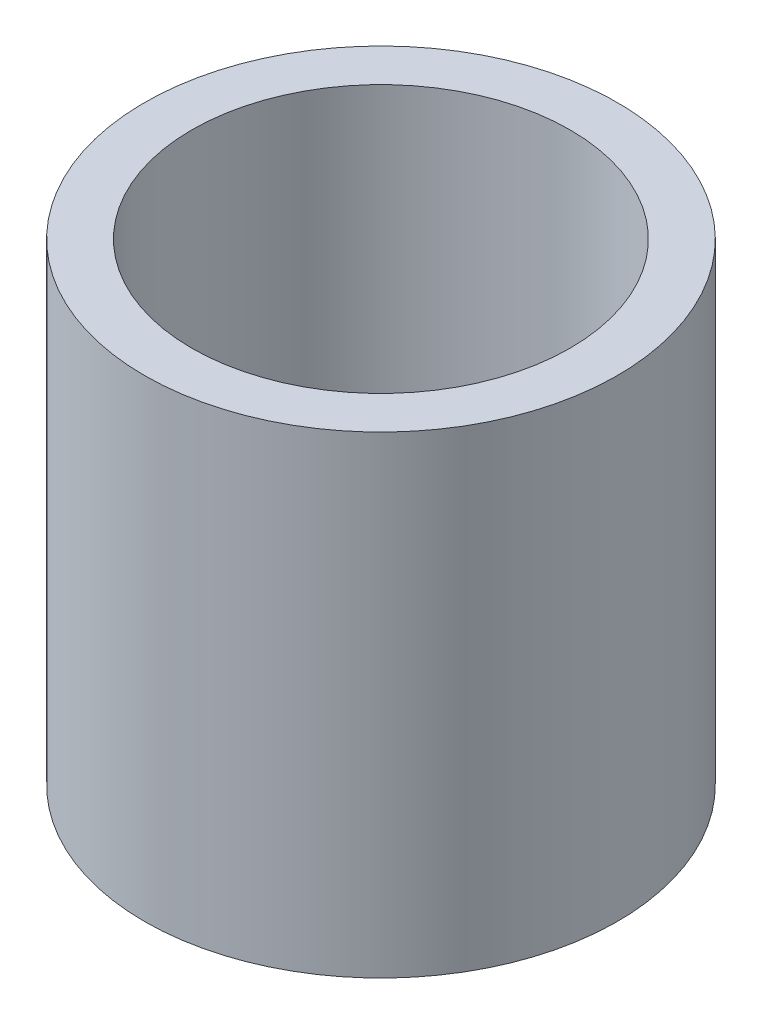
ISO-10303-21;
HEADER;
FILE_DESCRIPTION(('STEP AP214'),'2;1');
FILE_NAME('part.step','',(''),(''),'','','');
FILE_SCHEMA(('AUTOMOTIVE_DESIGN { 1 0 10303 214 1 1 1 1 }'));
ENDSEC;
DATA;
#1=APPLICATION_CONTEXT('core data for automotive mechanical design processes');
#2=APPLICATION_PROTOCOL_DEFINITION('international standard','automotive_design',2000,#1);
#3=PRODUCT_CONTEXT('',#1,'mechanical');
#4=PRODUCT('Part','Part','',(#3));
#5=PRODUCT_RELATED_PRODUCT_CATEGORY('part','',(#4));
#6=PRODUCT_DEFINITION_FORMATION('','',#4);
#7=PRODUCT_DEFINITION_CONTEXT('part definition',#1,'design');
#8=PRODUCT_DEFINITION('design','',#6,#7);
#9=PRODUCT_DEFINITION_SHAPE('','',#8);
#10=(LENGTH_UNIT() NAMED_UNIT(*) SI_UNIT(.MILLI.,.METRE.));
#11=(NAMED_UNIT(*) PLANE_ANGLE_UNIT() SI_UNIT($,.RADIAN.));
#12=(NAMED_UNIT(*) SI_UNIT($,.STERADIAN.) SOLID_ANGLE_UNIT());
#13=UNCERTAINTY_MEASURE_WITH_UNIT(LENGTH_MEASURE(1.E-05),#10,'distance_accuracy_value','');
#14=(GEOMETRIC_REPRESENTATION_CONTEXT(3) GLOBAL_UNCERTAINTY_ASSIGNED_CONTEXT((#13)) GLOBAL_UNIT_ASSIGNED_CONTEXT((#10,
#11,#12)) REPRESENTATION_CONTEXT('',''));
#15=CARTESIAN_POINT('',(0.,0.,0.));
#16=DIRECTION('',(0.,0.,1.));
#17=DIRECTION('',(1.,0.,0.));
#18=AXIS2_PLACEMENT_3D('',#15,#16,#17);
#19=CARTESIAN_POINT('',(0.,6.35,0.));
#20=DIRECTION('',(0.,1.,0.));
#21=DIRECTION('',(0.,0.,1.));
#22=AXIS2_PLACEMENT_3D('',#19,#20,#21);
#23=PLANE('',#22);
#24=CARTESIAN_POINT('',(0.,6.35,0.));
#25=DIRECTION('',(0.,1.,0.));
#26=DIRECTION('',(0.,0.,1.));
#27=AXIS2_PLACEMENT_3D('',#24,#25,#26);
#28=CIRCLE('',#27,3.175);
#29=CARTESIAN_POINT('',(0.,6.35,3.175));
#30=VERTEX_POINT('',#29);
#31=EDGE_CURVE('E10',#30,#30,#28,.T.);
#32=ORIENTED_EDGE('',*,*,#31,.T.);
#33=EDGE_LOOP('',(#32));
#34=FACE_BOUND('',#33,.T.);
#35=CARTESIAN_POINT('',(0.,6.35,0.));
#36=DIRECTION('',(0.,1.,0.));
#37=DIRECTION('',(0.,0.,1.));
#38=AXIS2_PLACEMENT_3D('',#35,#36,#37);
#39=CIRCLE('',#38,2.54);
#40=CARTESIAN_POINT('',(0.,6.35,2.54));
#41=VERTEX_POINT('',#40);
#42=EDGE_CURVE('E42',#41,#41,#39,.T.);
#43=ORIENTED_EDGE('',*,*,#42,.F.);
#44=EDGE_LOOP('',(#43));
#45=FACE_BOUND('',#44,.T.);
#46=ADVANCED_FACE('F31',(#34,#45),#23,.T.);
#47=CARTESIAN_POINT('',(0.,0.,0.));
#48=DIRECTION('',(0.,1.,0.));
#49=DIRECTION('',(0.,0.,1.));
#50=AXIS2_PLACEMENT_3D('',#47,#48,#49);
#51=PLANE('',#50);
#52=CARTESIAN_POINT('',(0.,0.,0.));
#53=DIRECTION('',(0.,1.,0.));
#54=DIRECTION('',(0.,0.,1.));
#55=AXIS2_PLACEMENT_3D('',#52,#53,#54);
#56=CIRCLE('',#55,3.175);
#57=CARTESIAN_POINT('',(0.,0.,3.175));
#58=VERTEX_POINT('',#57);
#59=EDGE_CURVE('E35',#58,#58,#56,.T.);
#60=ORIENTED_EDGE('',*,*,#59,.F.);
#61=EDGE_LOOP('',(#60));
#62=FACE_BOUND('',#61,.T.);
#63=CARTESIAN_POINT('',(0.,0.,0.));
#64=DIRECTION('',(0.,1.,0.));
#65=DIRECTION('',(0.,0.,1.));
#66=AXIS2_PLACEMENT_3D('',#63,#64,#65);
#67=CIRCLE('',#66,2.54);
#68=CARTESIAN_POINT('',(0.,0.,2.54));
#69=VERTEX_POINT('',#68);
#70=EDGE_CURVE('E44',#69,#69,#67,.T.);
#71=ORIENTED_EDGE('',*,*,#70,.T.);
#72=EDGE_LOOP('',(#71));
#73=FACE_BOUND('',#72,.T.);
#74=ADVANCED_FACE('F54',(#62,#73),#51,.F.);
#75=CARTESIAN_POINT('',(0.,6.35,0.));
#76=DIRECTION('',(0.,-1.,0.));
#77=DIRECTION('',(0.,0.,-1.));
#78=AXIS2_PLACEMENT_3D('',#75,#76,#77);
#79=CYLINDRICAL_SURFACE('',#78,3.175);
#80=ORIENTED_EDGE('',*,*,#31,.F.);
#81=EDGE_LOOP('',(#80));
#82=FACE_BOUND('',#81,.T.);
#83=ORIENTED_EDGE('',*,*,#59,.T.);
#84=EDGE_LOOP('',(#83));
#85=FACE_BOUND('',#84,.T.);
#86=ADVANCED_FACE('F33',(#82,#85),#79,.T.);
#87=CARTESIAN_POINT('',(0.,6.35,0.));
#88=DIRECTION('',(0.,-1.,0.));
#89=DIRECTION('',(0.,0.,-1.));
#90=AXIS2_PLACEMENT_3D('',#87,#88,#89);
#91=CYLINDRICAL_SURFACE('',#90,2.54);
#92=ORIENTED_EDGE('',*,*,#42,.T.);
#93=EDGE_LOOP('',(#92));
#94=FACE_BOUND('',#93,.T.);
#95=ORIENTED_EDGE('',*,*,#70,.F.);
#96=EDGE_LOOP('',(#95));
#97=FACE_BOUND('',#96,.T.);
#98=ADVANCED_FACE('F50',(#94,#97),#91,.F.);
#99=CLOSED_SHELL('',(#46,#74,#86,#98));
#100=MANIFOLD_SOLID_BREP('B2',#99);
#101=ADVANCED_BREP_SHAPE_REPRESENTATION('',(#18,#100),#14);
#102=SHAPE_DEFINITION_REPRESENTATION(#9,#101);
ENDSEC;
END-ISO-10303-21;
